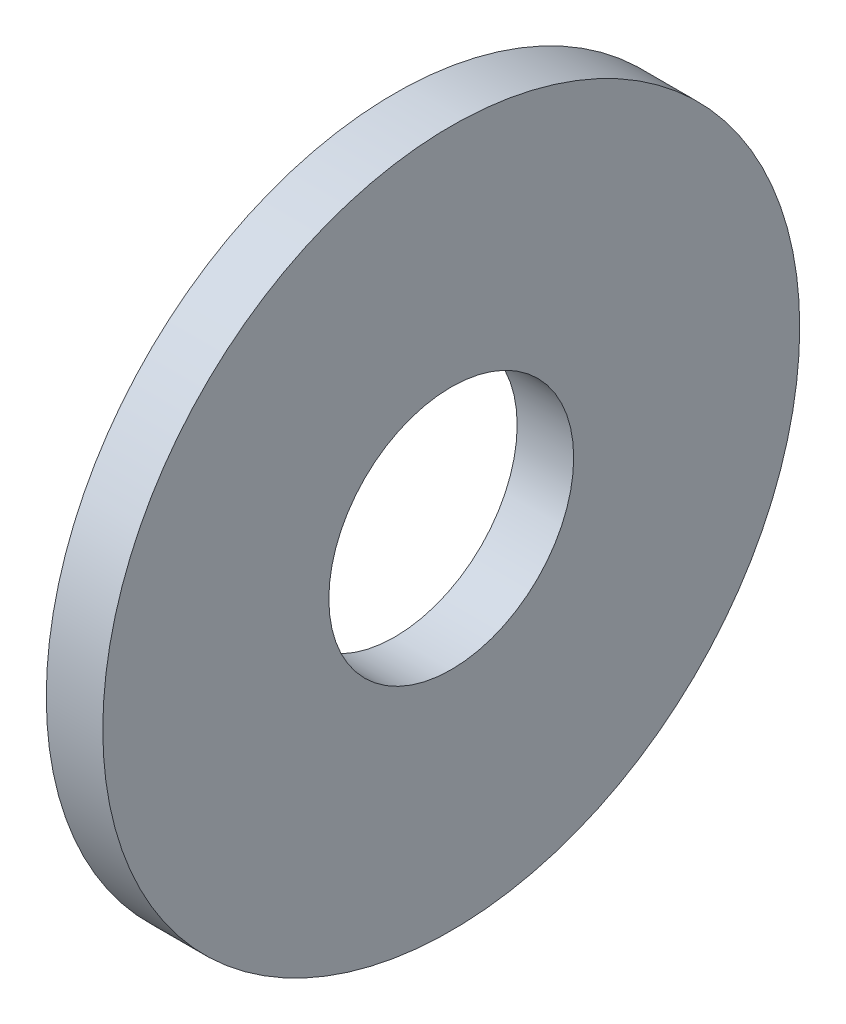
ISO-10303-21;
HEADER;
FILE_DESCRIPTION(('STEP AP214'),'2;1');
FILE_NAME('part.step','',(''),(''),'','','');
FILE_SCHEMA(('AUTOMOTIVE_DESIGN { 1 0 10303 214 1 1 1 1 }'));
ENDSEC;
DATA;
#1=APPLICATION_CONTEXT('core data for automotive mechanical design processes');
#2=APPLICATION_PROTOCOL_DEFINITION('international standard','automotive_design',2000,#1);
#3=PRODUCT_CONTEXT('',#1,'mechanical');
#4=PRODUCT('Part','Part','',(#3));
#5=PRODUCT_RELATED_PRODUCT_CATEGORY('part','',(#4));
#6=PRODUCT_DEFINITION_FORMATION('','',#4);
#7=PRODUCT_DEFINITION_CONTEXT('part definition',#1,'design');
#8=PRODUCT_DEFINITION('design','',#6,#7);
#9=PRODUCT_DEFINITION_SHAPE('','',#8);
#10=(LENGTH_UNIT() NAMED_UNIT(*) SI_UNIT(.MILLI.,.METRE.));
#11=(NAMED_UNIT(*) PLANE_ANGLE_UNIT() SI_UNIT($,.RADIAN.));
#12=(NAMED_UNIT(*) SI_UNIT($,.STERADIAN.) SOLID_ANGLE_UNIT());
#13=UNCERTAINTY_MEASURE_WITH_UNIT(LENGTH_MEASURE(1.E-05),#10,'distance_accuracy_value','');
#14=(GEOMETRIC_REPRESENTATION_CONTEXT(3) GLOBAL_UNCERTAINTY_ASSIGNED_CONTEXT((#13)) GLOBAL_UNIT_ASSIGNED_CONTEXT((#10,
#11,#12)) REPRESENTATION_CONTEXT('',''));
#15=CARTESIAN_POINT('',(0.,0.,0.));
#16=DIRECTION('',(0.,0.,1.));
#17=DIRECTION('',(1.,0.,0.));
#18=AXIS2_PLACEMENT_3D('',#15,#16,#17);
#19=CARTESIAN_POINT('',(-34.9249999999999,0.,0.));
#20=DIRECTION('',(-1.,0.,0.));
#21=DIRECTION('',(0.,0.,1.));
#22=AXIS2_PLACEMENT_3D('',#19,#20,#21);
#23=CYLINDRICAL_SURFACE('',#22,6.5);
#24=CARTESIAN_POINT('',(0.,0.,0.));
#25=DIRECTION('',(-1.,0.,0.));
#26=DIRECTION('',(0.,0.,1.));
#27=AXIS2_PLACEMENT_3D('',#24,#25,#26);
#28=CIRCLE('',#27,6.5);
#29=CARTESIAN_POINT('',(0.,0.,6.5));
#30=VERTEX_POINT('',#29);
#31=EDGE_CURVE('E44',#30,#30,#28,.T.);
#32=ORIENTED_EDGE('',*,*,#31,.F.);
#33=EDGE_LOOP('',(#32));
#34=FACE_BOUND('',#33,.T.);
#35=CARTESIAN_POINT('',(-3.,0.,0.));
#36=DIRECTION('',(-1.,0.,0.));
#37=DIRECTION('',(0.,0.,1.));
#38=AXIS2_PLACEMENT_3D('',#35,#36,#37);
#39=CIRCLE('',#38,6.5);
#40=CARTESIAN_POINT('',(-3.,0.,6.5));
#41=VERTEX_POINT('',#40);
#42=EDGE_CURVE('E10',#41,#41,#39,.T.);
#43=ORIENTED_EDGE('',*,*,#42,.T.);
#44=EDGE_LOOP('',(#43));
#45=FACE_BOUND('',#44,.T.);
#46=ADVANCED_FACE('F30',(#34,#45),#23,.F.);
#47=CARTESIAN_POINT('',(-3.,18.5,0.));
#48=DIRECTION('',(1.,0.,0.));
#49=DIRECTION('',(0.,0.,-1.));
#50=AXIS2_PLACEMENT_3D('',#47,#48,#49);
#51=PLANE('',#50);
#52=ORIENTED_EDGE('',*,*,#42,.F.);
#53=EDGE_LOOP('',(#52));
#54=FACE_BOUND('',#53,.T.);
#55=CARTESIAN_POINT('',(-3.,0.,0.));
#56=DIRECTION('',(-1.,0.,0.));
#57=DIRECTION('',(0.,0.,1.));
#58=AXIS2_PLACEMENT_3D('',#55,#56,#57);
#59=CIRCLE('',#58,18.5);
#60=CARTESIAN_POINT('',(-3.,0.,18.5));
#61=VERTEX_POINT('',#60);
#62=EDGE_CURVE('E36',#61,#61,#59,.T.);
#63=ORIENTED_EDGE('',*,*,#62,.T.);
#64=EDGE_LOOP('',(#63));
#65=FACE_BOUND('',#64,.T.);
#66=ADVANCED_FACE('F53',(#54,#65),#51,.F.);
#67=CARTESIAN_POINT('',(-34.9249999999999,0.,0.));
#68=DIRECTION('',(-1.,0.,0.));
#69=DIRECTION('',(0.,0.,1.));
#70=AXIS2_PLACEMENT_3D('',#67,#68,#69);
#71=CYLINDRICAL_SURFACE('',#70,18.5);
#72=ORIENTED_EDGE('',*,*,#62,.F.);
#73=EDGE_LOOP('',(#72));
#74=FACE_BOUND('',#73,.T.);
#75=CARTESIAN_POINT('',(0.,0.,0.));
#76=DIRECTION('',(-1.,0.,0.));
#77=DIRECTION('',(0.,0.,1.));
#78=AXIS2_PLACEMENT_3D('',#75,#76,#77);
#79=CIRCLE('',#78,18.5);
#80=CARTESIAN_POINT('',(0.,0.,18.5));
#81=VERTEX_POINT('',#80);
#82=EDGE_CURVE('E40',#81,#81,#79,.T.);
#83=ORIENTED_EDGE('',*,*,#82,.T.);
#84=EDGE_LOOP('',(#83));
#85=FACE_BOUND('',#84,.T.);
#86=ADVANCED_FACE('F57',(#74,#85),#71,.T.);
#87=CARTESIAN_POINT('',(0.,6.49999999999995,0.));
#88=DIRECTION('',(-1.,0.,0.));
#89=DIRECTION('',(0.,0.,1.));
#90=AXIS2_PLACEMENT_3D('',#87,#88,#89);
#91=PLANE('',#90);
#92=ORIENTED_EDGE('',*,*,#82,.F.);
#93=EDGE_LOOP('',(#92));
#94=FACE_BOUND('',#93,.T.);
#95=ORIENTED_EDGE('',*,*,#31,.T.);
#96=EDGE_LOOP('',(#95));
#97=FACE_BOUND('',#96,.T.);
#98=ADVANCED_FACE('F50',(#94,#97),#91,.F.);
#99=CLOSED_SHELL('',(#46,#66,#86,#98));
#100=MANIFOLD_SOLID_BREP('B2',#99);
#101=ADVANCED_BREP_SHAPE_REPRESENTATION('',(#18,#100),#14);
#102=SHAPE_DEFINITION_REPRESENTATION(#9,#101);
ENDSEC;
END-ISO-10303-21;
